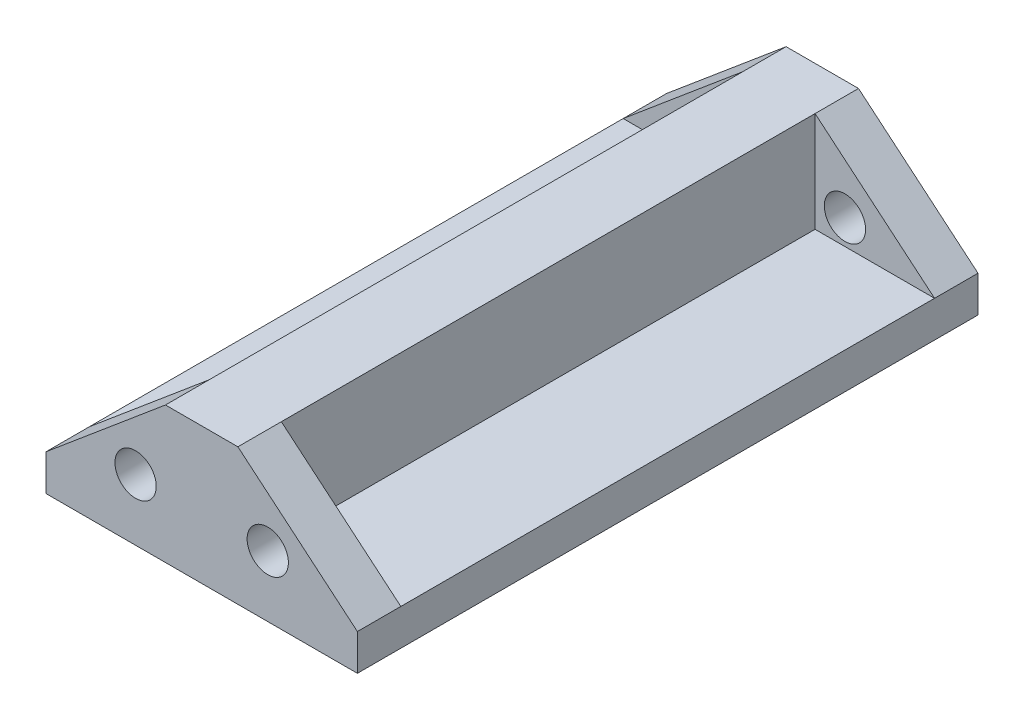
ISO-10303-21;
HEADER;
FILE_DESCRIPTION(('STEP AP214'),'2;1');
FILE_NAME('part.step','',(''),(''),'','','');
FILE_SCHEMA(('AUTOMOTIVE_DESIGN { 1 0 10303 214 1 1 1 1 }'));
ENDSEC;
DATA;
#1=APPLICATION_CONTEXT('core data for automotive mechanical design processes');
#2=APPLICATION_PROTOCOL_DEFINITION('international standard','automotive_design',2000,#1);
#3=PRODUCT_CONTEXT('',#1,'mechanical');
#4=PRODUCT('Part','Part','',(#3));
#5=PRODUCT_RELATED_PRODUCT_CATEGORY('part','',(#4));
#6=PRODUCT_DEFINITION_FORMATION('','',#4);
#7=PRODUCT_DEFINITION_CONTEXT('part definition',#1,'design');
#8=PRODUCT_DEFINITION('design','',#6,#7);
#9=PRODUCT_DEFINITION_SHAPE('','',#8);
#10=(LENGTH_UNIT() NAMED_UNIT(*) SI_UNIT(.MILLI.,.METRE.));
#11=(NAMED_UNIT(*) PLANE_ANGLE_UNIT() SI_UNIT($,.RADIAN.));
#12=(NAMED_UNIT(*) SI_UNIT($,.STERADIAN.) SOLID_ANGLE_UNIT());
#13=UNCERTAINTY_MEASURE_WITH_UNIT(LENGTH_MEASURE(1.E-05),#10,'distance_accuracy_value','');
#14=(GEOMETRIC_REPRESENTATION_CONTEXT(3) GLOBAL_UNCERTAINTY_ASSIGNED_CONTEXT((#13)) GLOBAL_UNIT_ASSIGNED_CONTEXT((#10,
#11,#12)) REPRESENTATION_CONTEXT('',''));
#15=CARTESIAN_POINT('',(0.,0.,0.));
#16=DIRECTION('',(0.,0.,1.));
#17=DIRECTION('',(1.,0.,0.));
#18=AXIS2_PLACEMENT_3D('',#15,#16,#17);
#19=CARTESIAN_POINT('',(6.70559051422187,7.99141158578954,85.7063165));
#20=DIRECTION('',(-0.642787609686541,-0.766044443118977,0.));
#21=DIRECTION('',(0.766044443118977,-0.642787609686541,0.));
#22=AXIS2_PLACEMENT_3D('',#19,#20,#21);
#23=PLANE('',#22);
#24=DIRECTION('',(0.,0.,-1.));
#25=VECTOR('',#24,1.);
#26=CARTESIAN_POINT('',(21.5,-4.42257195721259,85.7063165));
#27=LINE('',#26,#25);
#28=CARTESIAN_POINT('',(21.5,-4.42257195721259,85.7063165));
#29=VERTEX_POINT('',#28);
#30=CARTESIAN_POINT('',(21.5,-4.42257195721259,79.7063165));
#31=VERTEX_POINT('',#30);
#32=EDGE_CURVE('E59',#29,#31,#27,.T.);
#33=ORIENTED_EDGE('',*,*,#32,.T.);
#34=DIRECTION('',(0.766044443118977,-0.642787609686541,0.));
#35=VECTOR('',#34,1.);
#36=CARTESIAN_POINT('',(21.5,-4.42257195721259,79.7063165));
#37=LINE('',#36,#35);
#38=CARTESIAN_POINT('',(5.00000000000001,9.42257195721258,79.7063165));
#39=VERTEX_POINT('',#38);
#40=EDGE_CURVE('E258',#39,#31,#37,.T.);
#41=ORIENTED_EDGE('',*,*,#40,.F.);
#42=DIRECTION('',(0.,0.,-1.));
#43=VECTOR('',#42,1.);
#44=CARTESIAN_POINT('',(5.00000000000001,9.42257195721258,85.7063165));
#45=LINE('',#44,#43);
#46=CARTESIAN_POINT('',(5.00000000000001,9.42257195721258,85.7063165));
#47=VERTEX_POINT('',#46);
#48=EDGE_CURVE('E193',#47,#39,#45,.T.);
#49=ORIENTED_EDGE('',*,*,#48,.F.);
#50=DIRECTION('',(-0.766044443118977,0.642787609686541,0.));
#51=VECTOR('',#50,1.);
#52=CARTESIAN_POINT('',(6.70559051422187,7.99141158578954,85.7063165));
#53=LINE('',#52,#51);
#54=EDGE_CURVE('E287',#29,#47,#53,.T.);
#55=ORIENTED_EDGE('',*,*,#54,.F.);
#56=EDGE_LOOP('',(#33,#41,#49,#55));
#57=FACE_BOUND('',#56,.T.);
#58=ADVANCED_FACE('F49',(#57),#23,.F.);
#59=CARTESIAN_POINT('',(-6.70559051422187,7.99141158578954,85.7063165));
#60=DIRECTION('',(0.642787609686541,-0.766044443118977,0.));
#61=DIRECTION('',(0.766044443118977,0.642787609686541,0.));
#62=AXIS2_PLACEMENT_3D('',#59,#60,#61);
#63=PLANE('',#62);
#64=DIRECTION('',(0.,0.,-1.));
#65=VECTOR('',#64,1.);
#66=CARTESIAN_POINT('',(-4.99999999999999,9.42257195721258,85.7063165));
#67=LINE('',#66,#65);
#68=CARTESIAN_POINT('',(-4.99999999999999,9.42257195721258,85.7063165));
#69=VERTEX_POINT('',#68);
#70=CARTESIAN_POINT('',(-4.99999999999999,9.42257195721258,79.7063165));
#71=VERTEX_POINT('',#70);
#72=EDGE_CURVE('E173',#69,#71,#67,.T.);
#73=ORIENTED_EDGE('',*,*,#72,.T.);
#74=DIRECTION('',(0.766044443118977,0.642787609686541,0.));
#75=VECTOR('',#74,1.);
#76=CARTESIAN_POINT('',(-4.99999999999999,9.42257195721258,79.7063165));
#77=LINE('',#76,#75);
#78=CARTESIAN_POINT('',(-21.5,-4.42257195721258,79.7063165));
#79=VERTEX_POINT('',#78);
#80=EDGE_CURVE('E154',#79,#71,#77,.T.);
#81=ORIENTED_EDGE('',*,*,#80,.F.);
#82=DIRECTION('',(0.,0.,-1.));
#83=VECTOR('',#82,1.);
#84=CARTESIAN_POINT('',(-21.5,-4.42257195721258,85.7063165));
#85=LINE('',#84,#83);
#86=CARTESIAN_POINT('',(-21.5,-4.42257195721258,85.7063165));
#87=VERTEX_POINT('',#86);
#88=EDGE_CURVE('E170',#87,#79,#85,.T.);
#89=ORIENTED_EDGE('',*,*,#88,.F.);
#90=DIRECTION('',(-0.766044443118977,-0.642787609686541,0.));
#91=VECTOR('',#90,1.);
#92=CARTESIAN_POINT('',(-6.70559051422187,7.99141158578954,85.7063165));
#93=LINE('',#92,#91);
#94=EDGE_CURVE('E293',#69,#87,#93,.T.);
#95=ORIENTED_EDGE('',*,*,#94,.F.);
#96=EDGE_LOOP('',(#73,#81,#89,#95));
#97=FACE_BOUND('',#96,.T.);
#98=ADVANCED_FACE('F168',(#97),#63,.F.);
#99=CARTESIAN_POINT('',(0.,-9.42257195721259,85.7063165));
#100=DIRECTION('',(0.,1.,0.));
#101=DIRECTION('',(0.,0.,1.));
#102=AXIS2_PLACEMENT_3D('',#99,#100,#101);
#103=PLANE('',#102);
#104=DIRECTION('',(1.,0.,0.));
#105=VECTOR('',#104,1.);
#106=CARTESIAN_POINT('',(0.,-9.42257195721259,0.));
#107=LINE('',#106,#105);
#108=CARTESIAN_POINT('',(-21.5,-9.42257195721259,0.));
#109=VERTEX_POINT('',#108);
#110=CARTESIAN_POINT('',(21.5,-9.42257195721259,0.));
#111=VERTEX_POINT('',#110);
#112=EDGE_CURVE('E249',#109,#111,#107,.T.);
#113=ORIENTED_EDGE('',*,*,#112,.T.);
#114=DIRECTION('',(0.,0.,-1.));
#115=VECTOR('',#114,1.);
#116=CARTESIAN_POINT('',(21.5,-9.42257195721259,85.7063165));
#117=LINE('',#116,#115);
#118=CARTESIAN_POINT('',(21.5,-9.42257195721259,85.7063165));
#119=VERTEX_POINT('',#118);
#120=EDGE_CURVE('E12',#119,#111,#117,.T.);
#121=ORIENTED_EDGE('',*,*,#120,.F.);
#122=DIRECTION('',(1.,0.,0.));
#123=VECTOR('',#122,1.);
#124=CARTESIAN_POINT('',(0.,-9.42257195721259,85.7063165));
#125=LINE('',#124,#123);
#126=CARTESIAN_POINT('',(-21.5,-9.42257195721259,85.7063165));
#127=VERTEX_POINT('',#126);
#128=EDGE_CURVE('E279',#127,#119,#125,.T.);
#129=ORIENTED_EDGE('',*,*,#128,.F.);
#130=DIRECTION('',(0.,0.,-1.));
#131=VECTOR('',#130,1.);
#132=CARTESIAN_POINT('',(-21.5,-9.42257195721259,85.7063165));
#133=LINE('',#132,#131);
#134=EDGE_CURVE('E187',#127,#109,#133,.T.);
#135=ORIENTED_EDGE('',*,*,#134,.T.);
#136=EDGE_LOOP('',(#113,#121,#129,#135));
#137=FACE_BOUND('',#136,.T.);
#138=ADVANCED_FACE('F51',(#137),#103,.F.);
#139=CARTESIAN_POINT('',(21.5,0.,85.7063165));
#140=DIRECTION('',(-1.,0.,0.));
#141=DIRECTION('',(0.,-1.,0.));
#142=AXIS2_PLACEMENT_3D('',#139,#140,#141);
#143=PLANE('',#142);
#144=DIRECTION('',(0.,1.,0.));
#145=VECTOR('',#144,1.);
#146=CARTESIAN_POINT('',(21.5,0.,0.));
#147=LINE('',#146,#145);
#148=CARTESIAN_POINT('',(21.5,-4.42257195721259,0.));
#149=VERTEX_POINT('',#148);
#150=EDGE_CURVE('E301',#111,#149,#147,.T.);
#151=ORIENTED_EDGE('',*,*,#150,.T.);
#152=CARTESIAN_POINT('',(21.5,-4.42257195721259,6.));
#153=VERTEX_POINT('',#152);
#154=EDGE_CURVE('E197',#153,#149,#27,.T.);
#155=ORIENTED_EDGE('',*,*,#154,.F.);
#156=DIRECTION('',(0.,0.,-1.));
#157=VECTOR('',#156,1.);
#158=CARTESIAN_POINT('',(21.5,-4.42257195721259,107.245536773983));
#159=LINE('',#158,#157);
#160=EDGE_CURVE('E259',#31,#153,#159,.T.);
#161=ORIENTED_EDGE('',*,*,#160,.F.);
#162=ORIENTED_EDGE('',*,*,#32,.F.);
#163=DIRECTION('',(0.,1.,0.));
#164=VECTOR('',#163,1.);
#165=CARTESIAN_POINT('',(21.5,0.,85.7063165));
#166=LINE('',#165,#164);
#167=EDGE_CURVE('E283',#119,#29,#166,.T.);
#168=ORIENTED_EDGE('',*,*,#167,.F.);
#169=ORIENTED_EDGE('',*,*,#120,.T.);
#170=EDGE_LOOP('',(#151,#155,#161,#162,#168,#169));
#171=FACE_BOUND('',#170,.T.);
#172=ADVANCED_FACE('F331',(#171),#143,.F.);
#173=CARTESIAN_POINT('',(5.00000000000001,9.42257195721258,6.00000000000003));
#174=VERTEX_POINT('',#173);
#175=CARTESIAN_POINT('',(5.00000000000001,9.42257195721258,0.));
#176=VERTEX_POINT('',#175);
#177=EDGE_CURVE('E192',#174,#176,#45,.T.);
#178=ORIENTED_EDGE('',*,*,#177,.F.);
#179=DIRECTION('',(0.766044443118977,-0.642787609686541,0.));
#180=VECTOR('',#179,1.);
#181=CARTESIAN_POINT('',(21.5,-4.42257195721259,6.));
#182=LINE('',#181,#180);
#183=EDGE_CURVE('E67',#174,#153,#182,.T.);
#184=ORIENTED_EDGE('',*,*,#183,.T.);
#185=ORIENTED_EDGE('',*,*,#154,.T.);
#186=DIRECTION('',(-0.766044443118977,0.642787609686541,0.));
#187=VECTOR('',#186,1.);
#188=CARTESIAN_POINT('',(6.70559051422187,7.99141158578954,0.));
#189=LINE('',#188,#187);
#190=EDGE_CURVE('E305',#149,#176,#189,.T.);
#191=ORIENTED_EDGE('',*,*,#190,.T.);
#192=EDGE_LOOP('',(#178,#184,#185,#191));
#193=FACE_BOUND('',#192,.T.);
#194=ADVANCED_FACE('F350',(#193),#23,.F.);
#195=CARTESIAN_POINT('',(0.,9.42257195721258,85.7063165));
#196=DIRECTION('',(0.,-1.,0.));
#197=DIRECTION('',(0.,0.,-1.));
#198=AXIS2_PLACEMENT_3D('',#195,#196,#197);
#199=PLANE('',#198);
#200=DIRECTION('',(-1.,0.,0.));
#201=VECTOR('',#200,1.);
#202=CARTESIAN_POINT('',(0.,9.42257195721258,0.));
#203=LINE('',#202,#201);
#204=CARTESIAN_POINT('',(-4.99999999999999,9.42257195721258,0.));
#205=VERTEX_POINT('',#204);
#206=EDGE_CURVE('E309',#176,#205,#203,.T.);
#207=ORIENTED_EDGE('',*,*,#206,.T.);
#208=CARTESIAN_POINT('',(-4.99999999999999,9.42257195721258,6.));
#209=VERTEX_POINT('',#208);
#210=EDGE_CURVE('E181',#209,#205,#67,.T.);
#211=ORIENTED_EDGE('',*,*,#210,.F.);
#212=DIRECTION('',(0.,0.,-1.));
#213=VECTOR('',#212,1.);
#214=CARTESIAN_POINT('',(-4.99999999999999,9.42257195721258,107.245536773983));
#215=LINE('',#214,#213);
#216=EDGE_CURVE('E175',#71,#209,#215,.T.);
#217=ORIENTED_EDGE('',*,*,#216,.F.);
#218=ORIENTED_EDGE('',*,*,#72,.F.);
#219=DIRECTION('',(-1.,0.,0.));
#220=VECTOR('',#219,1.);
#221=CARTESIAN_POINT('',(0.,9.42257195721258,85.7063165));
#222=LINE('',#221,#220);
#223=EDGE_CURVE('E290',#47,#69,#222,.T.);
#224=ORIENTED_EDGE('',*,*,#223,.F.);
#225=ORIENTED_EDGE('',*,*,#48,.T.);
#226=DIRECTION('',(0.,0.,-1.));
#227=VECTOR('',#226,1.);
#228=CARTESIAN_POINT('',(5.00000000000001,9.42257195721258,107.245536773983));
#229=LINE('',#228,#227);
#230=EDGE_CURVE('E253',#39,#174,#229,.T.);
#231=ORIENTED_EDGE('',*,*,#230,.T.);
#232=ORIENTED_EDGE('',*,*,#177,.T.);
#233=EDGE_LOOP('',(#207,#211,#217,#218,#224,#225,#231,#232));
#234=FACE_BOUND('',#233,.T.);
#235=ADVANCED_FACE('F340',(#234),#199,.F.);
#236=CARTESIAN_POINT('',(-21.5,-4.42257195721258,6.00000000000003));
#237=VERTEX_POINT('',#236);
#238=CARTESIAN_POINT('',(-21.5,-4.42257195721258,0.));
#239=VERTEX_POINT('',#238);
#240=EDGE_CURVE('E182',#237,#239,#85,.T.);
#241=ORIENTED_EDGE('',*,*,#240,.F.);
#242=DIRECTION('',(0.766044443118977,0.642787609686541,0.));
#243=VECTOR('',#242,1.);
#244=CARTESIAN_POINT('',(-4.99999999999999,9.42257195721258,6.));
#245=LINE('',#244,#243);
#246=EDGE_CURVE('E75',#237,#209,#245,.T.);
#247=ORIENTED_EDGE('',*,*,#246,.T.);
#248=ORIENTED_EDGE('',*,*,#210,.T.);
#249=DIRECTION('',(-0.766044443118977,-0.642787609686541,0.));
#250=VECTOR('',#249,1.);
#251=CARTESIAN_POINT('',(-6.70559051422187,7.99141158578954,0.));
#252=LINE('',#251,#250);
#253=EDGE_CURVE('E313',#205,#239,#252,.T.);
#254=ORIENTED_EDGE('',*,*,#253,.T.);
#255=EDGE_LOOP('',(#241,#247,#248,#254));
#256=FACE_BOUND('',#255,.T.);
#257=ADVANCED_FACE('F346',(#256),#63,.F.);
#258=CARTESIAN_POINT('',(-21.5,0.,85.7063165));
#259=DIRECTION('',(1.,0.,0.));
#260=DIRECTION('',(0.,1.,0.));
#261=AXIS2_PLACEMENT_3D('',#258,#259,#260);
#262=PLANE('',#261);
#263=DIRECTION('',(0.,-1.,0.));
#264=VECTOR('',#263,1.);
#265=CARTESIAN_POINT('',(-21.5,0.,0.));
#266=LINE('',#265,#264);
#267=EDGE_CURVE('E284',#239,#109,#266,.T.);
#268=ORIENTED_EDGE('',*,*,#267,.T.);
#269=ORIENTED_EDGE('',*,*,#134,.F.);
#270=DIRECTION('',(0.,-1.,0.));
#271=VECTOR('',#270,1.);
#272=CARTESIAN_POINT('',(-21.5,0.,85.7063165));
#273=LINE('',#272,#271);
#274=EDGE_CURVE('E179',#87,#127,#273,.T.);
#275=ORIENTED_EDGE('',*,*,#274,.F.);
#276=ORIENTED_EDGE('',*,*,#88,.T.);
#277=DIRECTION('',(0.,0.,-1.));
#278=VECTOR('',#277,1.);
#279=CARTESIAN_POINT('',(-21.5,-4.42257195721258,107.245536773983));
#280=LINE('',#279,#278);
#281=EDGE_CURVE('E144',#79,#237,#280,.T.);
#282=ORIENTED_EDGE('',*,*,#281,.T.);
#283=ORIENTED_EDGE('',*,*,#240,.T.);
#284=EDGE_LOOP('',(#268,#269,#275,#276,#282,#283));
#285=FACE_BOUND('',#284,.T.);
#286=ADVANCED_FACE('F177',(#285),#262,.F.);
#287=CARTESIAN_POINT('',(0.,0.,85.7063165));
#288=DIRECTION('',(0.,0.,1.));
#289=DIRECTION('',(1.,0.,0.));
#290=AXIS2_PLACEMENT_3D('',#287,#288,#289);
#291=PLANE('',#290);
#292=CARTESIAN_POINT('',(-9.12500000000001,-0.961285978606277,85.7063165));
#293=DIRECTION('',(0.,0.,-1.));
#294=DIRECTION('',(-1.,0.,0.));
#295=AXIS2_PLACEMENT_3D('',#292,#293,#294);
#296=CIRCLE('',#295,2.85);
#297=CARTESIAN_POINT('',(-11.975,-0.961285978606277,85.7063165));
#298=VERTEX_POINT('',#297);
#299=EDGE_CURVE('E204',#298,#298,#296,.T.);
#300=ORIENTED_EDGE('',*,*,#299,.T.);
#301=EDGE_LOOP('',(#300));
#302=FACE_BOUND('',#301,.T.);
#303=CARTESIAN_POINT('',(9.12500000000001,-0.961285978606294,85.7063165));
#304=DIRECTION('',(0.,0.,-1.));
#305=DIRECTION('',(-1.,0.,0.));
#306=AXIS2_PLACEMENT_3D('',#303,#304,#305);
#307=CIRCLE('',#306,2.85);
#308=CARTESIAN_POINT('',(6.27500000000001,-0.961285978606294,85.7063165));
#309=VERTEX_POINT('',#308);
#310=EDGE_CURVE('E224',#309,#309,#307,.T.);
#311=ORIENTED_EDGE('',*,*,#310,.T.);
#312=EDGE_LOOP('',(#311));
#313=FACE_BOUND('',#312,.T.);
#314=ORIENTED_EDGE('',*,*,#128,.T.);
#315=ORIENTED_EDGE('',*,*,#167,.T.);
#316=ORIENTED_EDGE('',*,*,#54,.T.);
#317=ORIENTED_EDGE('',*,*,#223,.T.);
#318=ORIENTED_EDGE('',*,*,#94,.T.);
#319=ORIENTED_EDGE('',*,*,#274,.T.);
#320=EDGE_LOOP('',(#314,#315,#316,#317,#318,#319));
#321=FACE_BOUND('',#320,.T.);
#322=ADVANCED_FACE('F336',(#302,#313,#321),#291,.T.);
#323=CARTESIAN_POINT('',(0.,0.,0.));
#324=DIRECTION('',(0.,0.,1.));
#325=DIRECTION('',(1.,0.,0.));
#326=AXIS2_PLACEMENT_3D('',#323,#324,#325);
#327=PLANE('',#326);
#328=CARTESIAN_POINT('',(-9.12500000000001,-0.961285978606277,0.));
#329=DIRECTION('',(0.,0.,-1.));
#330=DIRECTION('',(-1.,0.,0.));
#331=AXIS2_PLACEMENT_3D('',#328,#329,#330);
#332=CIRCLE('',#331,2.85);
#333=CARTESIAN_POINT('',(-11.975,-0.961285978606277,0.));
#334=VERTEX_POINT('',#333);
#335=EDGE_CURVE('E212',#334,#334,#332,.T.);
#336=ORIENTED_EDGE('',*,*,#335,.F.);
#337=EDGE_LOOP('',(#336));
#338=FACE_BOUND('',#337,.T.);
#339=CARTESIAN_POINT('',(9.12500000000001,-0.961285978606294,0.));
#340=DIRECTION('',(0.,0.,-1.));
#341=DIRECTION('',(-1.,0.,0.));
#342=AXIS2_PLACEMENT_3D('',#339,#340,#341);
#343=CIRCLE('',#342,2.85);
#344=CARTESIAN_POINT('',(6.27500000000001,-0.961285978606294,0.));
#345=VERTEX_POINT('',#344);
#346=EDGE_CURVE('E218',#345,#345,#343,.T.);
#347=ORIENTED_EDGE('',*,*,#346,.F.);
#348=EDGE_LOOP('',(#347));
#349=FACE_BOUND('',#348,.T.);
#350=ORIENTED_EDGE('',*,*,#112,.F.);
#351=ORIENTED_EDGE('',*,*,#267,.F.);
#352=ORIENTED_EDGE('',*,*,#253,.F.);
#353=ORIENTED_EDGE('',*,*,#206,.F.);
#354=ORIENTED_EDGE('',*,*,#190,.F.);
#355=ORIENTED_EDGE('',*,*,#150,.F.);
#356=EDGE_LOOP('',(#350,#351,#352,#353,#354,#355));
#357=FACE_BOUND('',#356,.T.);
#358=ADVANCED_FACE('F326',(#338,#349,#357),#327,.F.);
#359=CARTESIAN_POINT('',(0.,0.,79.7063165));
#360=DIRECTION('',(0.,0.,1.));
#361=DIRECTION('',(1.,0.,0.));
#362=AXIS2_PLACEMENT_3D('',#359,#360,#361);
#363=PLANE('',#362);
#364=CARTESIAN_POINT('',(-9.12500000000001,-0.961285978606277,79.7063165));
#365=DIRECTION('',(0.,0.,1.));
#366=DIRECTION('',(1.,0.,0.));
#367=AXIS2_PLACEMENT_3D('',#364,#365,#366);
#368=CIRCLE('',#367,2.85);
#369=CARTESIAN_POINT('',(-6.27500000000001,-0.961285978606277,79.7063165));
#370=VERTEX_POINT('',#369);
#371=EDGE_CURVE('E228',#370,#370,#368,.T.);
#372=ORIENTED_EDGE('',*,*,#371,.T.);
#373=EDGE_LOOP('',(#372));
#374=FACE_BOUND('',#373,.T.);
#375=DIRECTION('',(0.,-1.,0.));
#376=VECTOR('',#375,1.);
#377=CARTESIAN_POINT('',(-4.99999999999999,9.42257195721258,79.7063165));
#378=LINE('',#377,#376);
#379=CARTESIAN_POINT('',(-4.99999999999999,-4.42257195721259,79.7063165));
#380=VERTEX_POINT('',#379);
#381=EDGE_CURVE('E161',#71,#380,#378,.T.);
#382=ORIENTED_EDGE('',*,*,#381,.T.);
#383=DIRECTION('',(-1.,0.,0.));
#384=VECTOR('',#383,1.);
#385=CARTESIAN_POINT('',(-4.99999999999999,-4.42257195721259,79.7063165));
#386=LINE('',#385,#384);
#387=EDGE_CURVE('E147',#380,#79,#386,.T.);
#388=ORIENTED_EDGE('',*,*,#387,.T.);
#389=ORIENTED_EDGE('',*,*,#80,.T.);
#390=EDGE_LOOP('',(#382,#388,#389));
#391=FACE_BOUND('',#390,.T.);
#392=ADVANCED_FACE('F159',(#374,#391),#363,.F.);
#393=CARTESIAN_POINT('',(0.,0.,6.));
#394=DIRECTION('',(0.,0.,-1.));
#395=DIRECTION('',(-1.,0.,0.));
#396=AXIS2_PLACEMENT_3D('',#393,#394,#395);
#397=PLANE('',#396);
#398=CARTESIAN_POINT('',(-9.12500000000001,-0.961285978606277,6.00000000000001));
#399=DIRECTION('',(0.,0.,-1.));
#400=DIRECTION('',(-1.,0.,0.));
#401=AXIS2_PLACEMENT_3D('',#398,#399,#400);
#402=CIRCLE('',#401,2.85);
#403=CARTESIAN_POINT('',(-11.975,-0.961285978606277,6.00000000000001));
#404=VERTEX_POINT('',#403);
#405=EDGE_CURVE('E53',#404,#404,#402,.T.);
#406=ORIENTED_EDGE('',*,*,#405,.T.);
#407=EDGE_LOOP('',(#406));
#408=FACE_BOUND('',#407,.T.);
#409=DIRECTION('',(0.,-1.,0.));
#410=VECTOR('',#409,1.);
#411=CARTESIAN_POINT('',(-4.99999999999999,9.42257195721258,6.));
#412=LINE('',#411,#410);
#413=CARTESIAN_POINT('',(-4.99999999999999,-4.42257195721259,6.));
#414=VERTEX_POINT('',#413);
#415=EDGE_CURVE('E237',#209,#414,#412,.T.);
#416=ORIENTED_EDGE('',*,*,#415,.F.);
#417=ORIENTED_EDGE('',*,*,#246,.F.);
#418=DIRECTION('',(-1.,0.,0.));
#419=VECTOR('',#418,1.);
#420=CARTESIAN_POINT('',(-4.99999999999999,-4.42257195721259,6.));
#421=LINE('',#420,#419);
#422=EDGE_CURVE('E149',#414,#237,#421,.T.);
#423=ORIENTED_EDGE('',*,*,#422,.F.);
#424=EDGE_LOOP('',(#416,#417,#423));
#425=FACE_BOUND('',#424,.T.);
#426=ADVANCED_FACE('F344',(#408,#425),#397,.F.);
#427=CARTESIAN_POINT('',(-4.99999999999999,-4.42257195721259,107.245536773983));
#428=DIRECTION('',(0.,-1.,0.));
#429=DIRECTION('',(1.,0.,0.));
#430=AXIS2_PLACEMENT_3D('',#427,#428,#429);
#431=PLANE('',#430);
#432=DIRECTION('',(0.,0.,-1.));
#433=VECTOR('',#432,1.);
#434=CARTESIAN_POINT('',(-4.99999999999999,-4.42257195721259,107.245536773983));
#435=LINE('',#434,#433);
#436=EDGE_CURVE('E243',#380,#414,#435,.T.);
#437=ORIENTED_EDGE('',*,*,#436,.T.);
#438=ORIENTED_EDGE('',*,*,#422,.T.);
#439=ORIENTED_EDGE('',*,*,#281,.F.);
#440=ORIENTED_EDGE('',*,*,#387,.F.);
#441=EDGE_LOOP('',(#437,#438,#439,#440));
#442=FACE_BOUND('',#441,.T.);
#443=ADVANCED_FACE('F146',(#442),#431,.F.);
#444=CARTESIAN_POINT('',(-4.99999999999999,9.42257195721258,107.245536773983));
#445=DIRECTION('',(1.,0.,0.));
#446=DIRECTION('',(0.,0.,-1.));
#447=AXIS2_PLACEMENT_3D('',#444,#445,#446);
#448=PLANE('',#447);
#449=ORIENTED_EDGE('',*,*,#216,.T.);
#450=ORIENTED_EDGE('',*,*,#415,.T.);
#451=ORIENTED_EDGE('',*,*,#436,.F.);
#452=ORIENTED_EDGE('',*,*,#381,.F.);
#453=EDGE_LOOP('',(#449,#450,#451,#452));
#454=FACE_BOUND('',#453,.T.);
#455=ADVANCED_FACE('F343',(#454),#448,.F.);
#456=CARTESIAN_POINT('',(0.,0.,79.7063165));
#457=DIRECTION('',(0.,0.,1.));
#458=DIRECTION('',(1.,0.,0.));
#459=AXIS2_PLACEMENT_3D('',#456,#457,#458);
#460=PLANE('',#459);
#461=CARTESIAN_POINT('',(9.12500000000001,-0.961285978606294,79.7063165));
#462=DIRECTION('',(0.,0.,1.));
#463=DIRECTION('',(1.,0.,0.));
#464=AXIS2_PLACEMENT_3D('',#461,#462,#463);
#465=CIRCLE('',#464,2.85);
#466=CARTESIAN_POINT('',(11.975,-0.961285978606294,79.7063165));
#467=VERTEX_POINT('',#466);
#468=EDGE_CURVE('E203',#467,#467,#465,.T.);
#469=ORIENTED_EDGE('',*,*,#468,.T.);
#470=EDGE_LOOP('',(#469));
#471=FACE_BOUND('',#470,.T.);
#472=DIRECTION('',(-1.,0.,0.));
#473=VECTOR('',#472,1.);
#474=CARTESIAN_POINT('',(21.5,-4.42257195721259,79.7063165));
#475=LINE('',#474,#473);
#476=CARTESIAN_POINT('',(5.00000000000001,-4.42257195721259,79.7063165));
#477=VERTEX_POINT('',#476);
#478=EDGE_CURVE('E252',#31,#477,#475,.T.);
#479=ORIENTED_EDGE('',*,*,#478,.T.);
#480=DIRECTION('',(0.,1.,0.));
#481=VECTOR('',#480,1.);
#482=CARTESIAN_POINT('',(5.00000000000001,-4.42257195721259,79.7063165));
#483=LINE('',#482,#481);
#484=EDGE_CURVE('E257',#477,#39,#483,.T.);
#485=ORIENTED_EDGE('',*,*,#484,.T.);
#486=ORIENTED_EDGE('',*,*,#40,.T.);
#487=EDGE_LOOP('',(#479,#485,#486));
#488=FACE_BOUND('',#487,.T.);
#489=ADVANCED_FACE('F356',(#471,#488),#460,.F.);
#490=CARTESIAN_POINT('',(0.,0.,6.));
#491=DIRECTION('',(0.,0.,-1.));
#492=DIRECTION('',(-1.,0.,0.));
#493=AXIS2_PLACEMENT_3D('',#490,#491,#492);
#494=PLANE('',#493);
#495=CARTESIAN_POINT('',(9.12500000000001,-0.961285978606294,6.00000000000001));
#496=DIRECTION('',(0.,0.,-1.));
#497=DIRECTION('',(-1.,0.,0.));
#498=AXIS2_PLACEMENT_3D('',#495,#496,#497);
#499=CIRCLE('',#498,2.85);
#500=CARTESIAN_POINT('',(6.27500000000001,-0.961285978606294,6.00000000000001));
#501=VERTEX_POINT('',#500);
#502=EDGE_CURVE('E200',#501,#501,#499,.T.);
#503=ORIENTED_EDGE('',*,*,#502,.T.);
#504=EDGE_LOOP('',(#503));
#505=FACE_BOUND('',#504,.T.);
#506=DIRECTION('',(-1.,0.,0.));
#507=VECTOR('',#506,1.);
#508=CARTESIAN_POINT('',(21.5,-4.42257195721259,6.));
#509=LINE('',#508,#507);
#510=CARTESIAN_POINT('',(5.00000000000001,-4.42257195721259,6.));
#511=VERTEX_POINT('',#510);
#512=EDGE_CURVE('E240',#153,#511,#509,.T.);
#513=ORIENTED_EDGE('',*,*,#512,.F.);
#514=ORIENTED_EDGE('',*,*,#183,.F.);
#515=DIRECTION('',(0.,1.,0.));
#516=VECTOR('',#515,1.);
#517=CARTESIAN_POINT('',(5.00000000000001,-4.42257195721259,6.));
#518=LINE('',#517,#516);
#519=EDGE_CURVE('E274',#511,#174,#518,.T.);
#520=ORIENTED_EDGE('',*,*,#519,.F.);
#521=EDGE_LOOP('',(#513,#514,#520));
#522=FACE_BOUND('',#521,.T.);
#523=ADVANCED_FACE('F360',(#505,#522),#494,.F.);
#524=CARTESIAN_POINT('',(5.00000000000001,-4.42257195721259,107.245536773983));
#525=DIRECTION('',(-1.,0.,0.));
#526=DIRECTION('',(0.,0.,1.));
#527=AXIS2_PLACEMENT_3D('',#524,#525,#526);
#528=PLANE('',#527);
#529=DIRECTION('',(0.,0.,-1.));
#530=VECTOR('',#529,1.);
#531=CARTESIAN_POINT('',(5.00000000000001,-4.42257195721259,107.245536773983));
#532=LINE('',#531,#530);
#533=EDGE_CURVE('E232',#477,#511,#532,.T.);
#534=ORIENTED_EDGE('',*,*,#533,.T.);
#535=ORIENTED_EDGE('',*,*,#519,.T.);
#536=ORIENTED_EDGE('',*,*,#230,.F.);
#537=ORIENTED_EDGE('',*,*,#484,.F.);
#538=EDGE_LOOP('',(#534,#535,#536,#537));
#539=FACE_BOUND('',#538,.T.);
#540=ADVANCED_FACE('F359',(#539),#528,.F.);
#541=CARTESIAN_POINT('',(21.5,-4.42257195721259,107.245536773983));
#542=DIRECTION('',(0.,-1.,0.));
#543=DIRECTION('',(0.,0.,-1.));
#544=AXIS2_PLACEMENT_3D('',#541,#542,#543);
#545=PLANE('',#544);
#546=ORIENTED_EDGE('',*,*,#160,.T.);
#547=ORIENTED_EDGE('',*,*,#512,.T.);
#548=ORIENTED_EDGE('',*,*,#533,.F.);
#549=ORIENTED_EDGE('',*,*,#478,.F.);
#550=EDGE_LOOP('',(#546,#547,#548,#549));
#551=FACE_BOUND('',#550,.T.);
#552=ADVANCED_FACE('F361',(#551),#545,.F.);
#553=CARTESIAN_POINT('',(9.12500000000001,-0.961285978606294,85.7063165));
#554=DIRECTION('',(0.,0.,-1.));
#555=DIRECTION('',(-1.,0.,0.));
#556=AXIS2_PLACEMENT_3D('',#553,#554,#555);
#557=CYLINDRICAL_SURFACE('',#556,2.85);
#558=ORIENTED_EDGE('',*,*,#346,.T.);
#559=EDGE_LOOP('',(#558));
#560=FACE_BOUND('',#559,.T.);
#561=ORIENTED_EDGE('',*,*,#502,.F.);
#562=EDGE_LOOP('',(#561));
#563=FACE_BOUND('',#562,.T.);
#564=ADVANCED_FACE('F363',(#560,#563),#557,.F.);
#565=ORIENTED_EDGE('',*,*,#310,.F.);
#566=EDGE_LOOP('',(#565));
#567=FACE_BOUND('',#566,.T.);
#568=ORIENTED_EDGE('',*,*,#468,.F.);
#569=EDGE_LOOP('',(#568));
#570=FACE_BOUND('',#569,.T.);
#571=ADVANCED_FACE('F370',(#567,#570),#557,.F.);
#572=CARTESIAN_POINT('',(-9.12500000000001,-0.961285978606277,85.7063165));
#573=DIRECTION('',(0.,0.,-1.));
#574=DIRECTION('',(-1.,0.,0.));
#575=AXIS2_PLACEMENT_3D('',#572,#573,#574);
#576=CYLINDRICAL_SURFACE('',#575,2.85);
#577=ORIENTED_EDGE('',*,*,#335,.T.);
#578=EDGE_LOOP('',(#577));
#579=FACE_BOUND('',#578,.T.);
#580=ORIENTED_EDGE('',*,*,#405,.F.);
#581=EDGE_LOOP('',(#580));
#582=FACE_BOUND('',#581,.T.);
#583=ADVANCED_FACE('F522',(#579,#582),#576,.F.);
#584=ORIENTED_EDGE('',*,*,#299,.F.);
#585=EDGE_LOOP('',(#584));
#586=FACE_BOUND('',#585,.T.);
#587=ORIENTED_EDGE('',*,*,#371,.F.);
#588=EDGE_LOOP('',(#587));
#589=FACE_BOUND('',#588,.T.);
#590=ADVANCED_FACE('F531',(#586,#589),#576,.F.);
#591=CLOSED_SHELL('',(#58,#98,#138,#172,#194,#235,#257,#286,#322,#358,#392,#426,#443,#455,#489,
#523,#540,#552,#564,#571,#583,#590));
#592=MANIFOLD_SOLID_BREP('B2',#591);
#593=ADVANCED_BREP_SHAPE_REPRESENTATION('',(#18,#592),#14);
#594=SHAPE_DEFINITION_REPRESENTATION(#9,#593);
ENDSEC;
END-ISO-10303-21;
